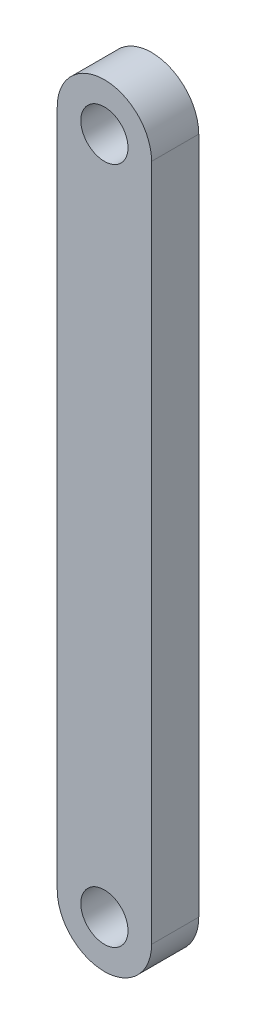
ISO-10303-21;
HEADER;
FILE_DESCRIPTION(('STEP AP214'),'2;1');
FILE_NAME('part.step','',(''),(''),'','','');
FILE_SCHEMA(('AUTOMOTIVE_DESIGN { 1 0 10303 214 1 1 1 1 }'));
ENDSEC;
DATA;
#1=APPLICATION_CONTEXT('core data for automotive mechanical design processes');
#2=APPLICATION_PROTOCOL_DEFINITION('international standard','automotive_design',2000,#1);
#3=PRODUCT_CONTEXT('',#1,'mechanical');
#4=PRODUCT('Part','Part','',(#3));
#5=PRODUCT_RELATED_PRODUCT_CATEGORY('part','',(#4));
#6=PRODUCT_DEFINITION_FORMATION('','',#4);
#7=PRODUCT_DEFINITION_CONTEXT('part definition',#1,'design');
#8=PRODUCT_DEFINITION('design','',#6,#7);
#9=PRODUCT_DEFINITION_SHAPE('','',#8);
#10=(LENGTH_UNIT() NAMED_UNIT(*) SI_UNIT(.MILLI.,.METRE.));
#11=(NAMED_UNIT(*) PLANE_ANGLE_UNIT() SI_UNIT($,.RADIAN.));
#12=(NAMED_UNIT(*) SI_UNIT($,.STERADIAN.) SOLID_ANGLE_UNIT());
#13=UNCERTAINTY_MEASURE_WITH_UNIT(LENGTH_MEASURE(1.E-05),#10,'distance_accuracy_value','');
#14=(GEOMETRIC_REPRESENTATION_CONTEXT(3) GLOBAL_UNCERTAINTY_ASSIGNED_CONTEXT((#13)) GLOBAL_UNIT_ASSIGNED_CONTEXT((#10,
#11,#12)) REPRESENTATION_CONTEXT('',''));
#15=CARTESIAN_POINT('',(0.,0.,0.));
#16=DIRECTION('',(0.,0.,1.));
#17=DIRECTION('',(1.,0.,0.));
#18=AXIS2_PLACEMENT_3D('',#15,#16,#17);
#19=CARTESIAN_POINT('',(8.,0.,4.));
#20=DIRECTION('',(0.,0.,-1.));
#21=DIRECTION('',(-1.,0.,0.));
#22=AXIS2_PLACEMENT_3D('',#19,#20,#21);
#23=CYLINDRICAL_SURFACE('',#22,8.);
#24=CARTESIAN_POINT('',(8.,0.,-4.));
#25=DIRECTION('',(0.,0.,1.));
#26=DIRECTION('',(1.,0.,0.));
#27=AXIS2_PLACEMENT_3D('',#24,#25,#26);
#28=CIRCLE('',#27,8.);
#29=CARTESIAN_POINT('',(0.,0.,-4.));
#30=VERTEX_POINT('',#29);
#31=CARTESIAN_POINT('',(16.,0.,-4.));
#32=VERTEX_POINT('',#31);
#33=EDGE_CURVE('E96',#30,#32,#28,.T.);
#34=ORIENTED_EDGE('',*,*,#33,.T.);
#35=DIRECTION('',(0.,0.,-1.));
#36=VECTOR('',#35,1.);
#37=CARTESIAN_POINT('',(16.,0.,4.));
#38=LINE('',#37,#36);
#39=CARTESIAN_POINT('',(16.,0.,4.));
#40=VERTEX_POINT('',#39);
#41=EDGE_CURVE('E11',#40,#32,#38,.T.);
#42=ORIENTED_EDGE('',*,*,#41,.F.);
#43=CARTESIAN_POINT('',(8.,0.,4.));
#44=DIRECTION('',(0.,0.,1.));
#45=DIRECTION('',(1.,0.,0.));
#46=AXIS2_PLACEMENT_3D('',#43,#44,#45);
#47=CIRCLE('',#46,8.);
#48=CARTESIAN_POINT('',(0.,0.,4.));
#49=VERTEX_POINT('',#48);
#50=EDGE_CURVE('E84',#49,#40,#47,.T.);
#51=ORIENTED_EDGE('',*,*,#50,.F.);
#52=DIRECTION('',(0.,0.,-1.));
#53=VECTOR('',#52,1.);
#54=CARTESIAN_POINT('',(0.,0.,4.));
#55=LINE('',#54,#53);
#56=EDGE_CURVE('E92',#49,#30,#55,.T.);
#57=ORIENTED_EDGE('',*,*,#56,.T.);
#58=EDGE_LOOP('',(#34,#42,#51,#57));
#59=FACE_BOUND('',#58,.T.);
#60=ADVANCED_FACE('F33',(#59),#23,.T.);
#61=CARTESIAN_POINT('',(16.,0.,4.));
#62=DIRECTION('',(-1.,0.,0.));
#63=DIRECTION('',(0.,0.,1.));
#64=AXIS2_PLACEMENT_3D('',#61,#62,#63);
#65=PLANE('',#64);
#66=DIRECTION('',(0.,1.,0.));
#67=VECTOR('',#66,1.);
#68=CARTESIAN_POINT('',(16.,0.,-4.));
#69=LINE('',#68,#67);
#70=CARTESIAN_POINT('',(16.,115.,-4.));
#71=VERTEX_POINT('',#70);
#72=EDGE_CURVE('E88',#32,#71,#69,.T.);
#73=ORIENTED_EDGE('',*,*,#72,.T.);
#74=DIRECTION('',(0.,0.,-1.));
#75=VECTOR('',#74,1.);
#76=CARTESIAN_POINT('',(16.,115.,4.));
#77=LINE('',#76,#75);
#78=CARTESIAN_POINT('',(16.,115.,4.));
#79=VERTEX_POINT('',#78);
#80=EDGE_CURVE('E41',#79,#71,#77,.T.);
#81=ORIENTED_EDGE('',*,*,#80,.F.);
#82=DIRECTION('',(0.,1.,0.));
#83=VECTOR('',#82,1.);
#84=CARTESIAN_POINT('',(16.,0.,4.));
#85=LINE('',#84,#83);
#86=EDGE_CURVE('E79',#40,#79,#85,.T.);
#87=ORIENTED_EDGE('',*,*,#86,.F.);
#88=ORIENTED_EDGE('',*,*,#41,.T.);
#89=EDGE_LOOP('',(#73,#81,#87,#88));
#90=FACE_BOUND('',#89,.T.);
#91=ADVANCED_FACE('F87',(#90),#65,.F.);
#92=CARTESIAN_POINT('',(8.,115.,4.));
#93=DIRECTION('',(0.,0.,-1.));
#94=DIRECTION('',(-1.,0.,0.));
#95=AXIS2_PLACEMENT_3D('',#92,#93,#94);
#96=CYLINDRICAL_SURFACE('',#95,8.);
#97=CARTESIAN_POINT('',(8.,115.,-4.));
#98=DIRECTION('',(0.,0.,1.));
#99=DIRECTION('',(1.,0.,0.));
#100=AXIS2_PLACEMENT_3D('',#97,#98,#99);
#101=CIRCLE('',#100,8.);
#102=CARTESIAN_POINT('',(0.,115.,-4.));
#103=VERTEX_POINT('',#102);
#104=EDGE_CURVE('E66',#71,#103,#101,.T.);
#105=ORIENTED_EDGE('',*,*,#104,.T.);
#106=DIRECTION('',(0.,0.,-1.));
#107=VECTOR('',#106,1.);
#108=CARTESIAN_POINT('',(0.,115.,4.));
#109=LINE('',#108,#107);
#110=CARTESIAN_POINT('',(0.,115.,4.));
#111=VERTEX_POINT('',#110);
#112=EDGE_CURVE('E89',#111,#103,#109,.T.);
#113=ORIENTED_EDGE('',*,*,#112,.F.);
#114=CARTESIAN_POINT('',(8.,115.,4.));
#115=DIRECTION('',(0.,0.,1.));
#116=DIRECTION('',(1.,0.,0.));
#117=AXIS2_PLACEMENT_3D('',#114,#115,#116);
#118=CIRCLE('',#117,8.);
#119=EDGE_CURVE('E82',#79,#111,#118,.T.);
#120=ORIENTED_EDGE('',*,*,#119,.F.);
#121=ORIENTED_EDGE('',*,*,#80,.T.);
#122=EDGE_LOOP('',(#105,#113,#120,#121));
#123=FACE_BOUND('',#122,.T.);
#124=ADVANCED_FACE('F90',(#123),#96,.T.);
#125=CARTESIAN_POINT('',(0.,0.,4.));
#126=DIRECTION('',(1.,0.,0.));
#127=DIRECTION('',(0.,0.,-1.));
#128=AXIS2_PLACEMENT_3D('',#125,#126,#127);
#129=PLANE('',#128);
#130=DIRECTION('',(0.,-1.,0.));
#131=VECTOR('',#130,1.);
#132=CARTESIAN_POINT('',(0.,0.,-4.));
#133=LINE('',#132,#131);
#134=EDGE_CURVE('E72',#103,#30,#133,.T.);
#135=ORIENTED_EDGE('',*,*,#134,.T.);
#136=ORIENTED_EDGE('',*,*,#56,.F.);
#137=DIRECTION('',(0.,-1.,0.));
#138=VECTOR('',#137,1.);
#139=CARTESIAN_POINT('',(0.,0.,4.));
#140=LINE('',#139,#138);
#141=EDGE_CURVE('E49',#111,#49,#140,.T.);
#142=ORIENTED_EDGE('',*,*,#141,.F.);
#143=ORIENTED_EDGE('',*,*,#112,.T.);
#144=EDGE_LOOP('',(#135,#136,#142,#143));
#145=FACE_BOUND('',#144,.T.);
#146=ADVANCED_FACE('F104',(#145),#129,.F.);
#147=CARTESIAN_POINT('',(8.,0.,4.));
#148=DIRECTION('',(0.,0.,1.));
#149=DIRECTION('',(1.,0.,0.));
#150=AXIS2_PLACEMENT_3D('',#147,#148,#149);
#151=PLANE('',#150);
#152=CARTESIAN_POINT('',(8.,115.,4.));
#153=DIRECTION('',(0.,0.,1.));
#154=DIRECTION('',(1.,0.,0.));
#155=AXIS2_PLACEMENT_3D('',#152,#153,#154);
#156=CIRCLE('',#155,4.);
#157=CARTESIAN_POINT('',(12.,115.,4.));
#158=VERTEX_POINT('',#157);
#159=EDGE_CURVE('E116',#158,#158,#156,.T.);
#160=ORIENTED_EDGE('',*,*,#159,.F.);
#161=EDGE_LOOP('',(#160));
#162=FACE_BOUND('',#161,.T.);
#163=CARTESIAN_POINT('',(8.,0.,4.));
#164=DIRECTION('',(0.,0.,1.));
#165=DIRECTION('',(1.,0.,0.));
#166=AXIS2_PLACEMENT_3D('',#163,#164,#165);
#167=CIRCLE('',#166,4.);
#168=CARTESIAN_POINT('',(12.,0.,4.));
#169=VERTEX_POINT('',#168);
#170=EDGE_CURVE('E110',#169,#169,#167,.T.);
#171=ORIENTED_EDGE('',*,*,#170,.F.);
#172=EDGE_LOOP('',(#171));
#173=FACE_BOUND('',#172,.T.);
#174=ORIENTED_EDGE('',*,*,#50,.T.);
#175=ORIENTED_EDGE('',*,*,#86,.T.);
#176=ORIENTED_EDGE('',*,*,#119,.T.);
#177=ORIENTED_EDGE('',*,*,#141,.T.);
#178=EDGE_LOOP('',(#174,#175,#176,#177));
#179=FACE_BOUND('',#178,.T.);
#180=ADVANCED_FACE('F80',(#162,#173,#179),#151,.T.);
#181=CARTESIAN_POINT('',(8.,0.,-4.));
#182=DIRECTION('',(0.,0.,1.));
#183=DIRECTION('',(1.,0.,0.));
#184=AXIS2_PLACEMENT_3D('',#181,#182,#183);
#185=PLANE('',#184);
#186=CARTESIAN_POINT('',(8.,115.,-4.));
#187=DIRECTION('',(0.,0.,1.));
#188=DIRECTION('',(1.,0.,0.));
#189=AXIS2_PLACEMENT_3D('',#186,#187,#188);
#190=CIRCLE('',#189,4.);
#191=CARTESIAN_POINT('',(12.,115.,-4.));
#192=VERTEX_POINT('',#191);
#193=EDGE_CURVE('E99',#192,#192,#190,.T.);
#194=ORIENTED_EDGE('',*,*,#193,.T.);
#195=EDGE_LOOP('',(#194));
#196=FACE_BOUND('',#195,.T.);
#197=CARTESIAN_POINT('',(8.,0.,-4.));
#198=DIRECTION('',(0.,0.,1.));
#199=DIRECTION('',(1.,0.,0.));
#200=AXIS2_PLACEMENT_3D('',#197,#198,#199);
#201=CIRCLE('',#200,4.);
#202=CARTESIAN_POINT('',(12.,0.,-4.));
#203=VERTEX_POINT('',#202);
#204=EDGE_CURVE('E113',#203,#203,#201,.T.);
#205=ORIENTED_EDGE('',*,*,#204,.T.);
#206=EDGE_LOOP('',(#205));
#207=FACE_BOUND('',#206,.T.);
#208=ORIENTED_EDGE('',*,*,#33,.F.);
#209=ORIENTED_EDGE('',*,*,#134,.F.);
#210=ORIENTED_EDGE('',*,*,#104,.F.);
#211=ORIENTED_EDGE('',*,*,#72,.F.);
#212=EDGE_LOOP('',(#208,#209,#210,#211));
#213=FACE_BOUND('',#212,.T.);
#214=ADVANCED_FACE('F107',(#196,#207,#213),#185,.F.);
#215=CARTESIAN_POINT('',(8.,0.,-4.));
#216=DIRECTION('',(0.,0.,1.));
#217=DIRECTION('',(1.,0.,0.));
#218=AXIS2_PLACEMENT_3D('',#215,#216,#217);
#219=CYLINDRICAL_SURFACE('',#218,4.);
#220=ORIENTED_EDGE('',*,*,#204,.F.);
#221=EDGE_LOOP('',(#220));
#222=FACE_BOUND('',#221,.T.);
#223=ORIENTED_EDGE('',*,*,#170,.T.);
#224=EDGE_LOOP('',(#223));
#225=FACE_BOUND('',#224,.T.);
#226=ADVANCED_FACE('F127',(#222,#225),#219,.F.);
#227=CARTESIAN_POINT('',(8.,115.,-4.));
#228=DIRECTION('',(0.,0.,1.));
#229=DIRECTION('',(1.,0.,0.));
#230=AXIS2_PLACEMENT_3D('',#227,#228,#229);
#231=CYLINDRICAL_SURFACE('',#230,4.);
#232=ORIENTED_EDGE('',*,*,#193,.F.);
#233=EDGE_LOOP('',(#232));
#234=FACE_BOUND('',#233,.T.);
#235=ORIENTED_EDGE('',*,*,#159,.T.);
#236=EDGE_LOOP('',(#235));
#237=FACE_BOUND('',#236,.T.);
#238=ADVANCED_FACE('F124',(#234,#237),#231,.F.);
#239=CLOSED_SHELL('',(#60,#91,#124,#146,#180,#214,#226,#238));
#240=MANIFOLD_SOLID_BREP('B2',#239);
#241=ADVANCED_BREP_SHAPE_REPRESENTATION('',(#18,#240),#14);
#242=SHAPE_DEFINITION_REPRESENTATION(#9,#241);
ENDSEC;
END-ISO-10303-21;
